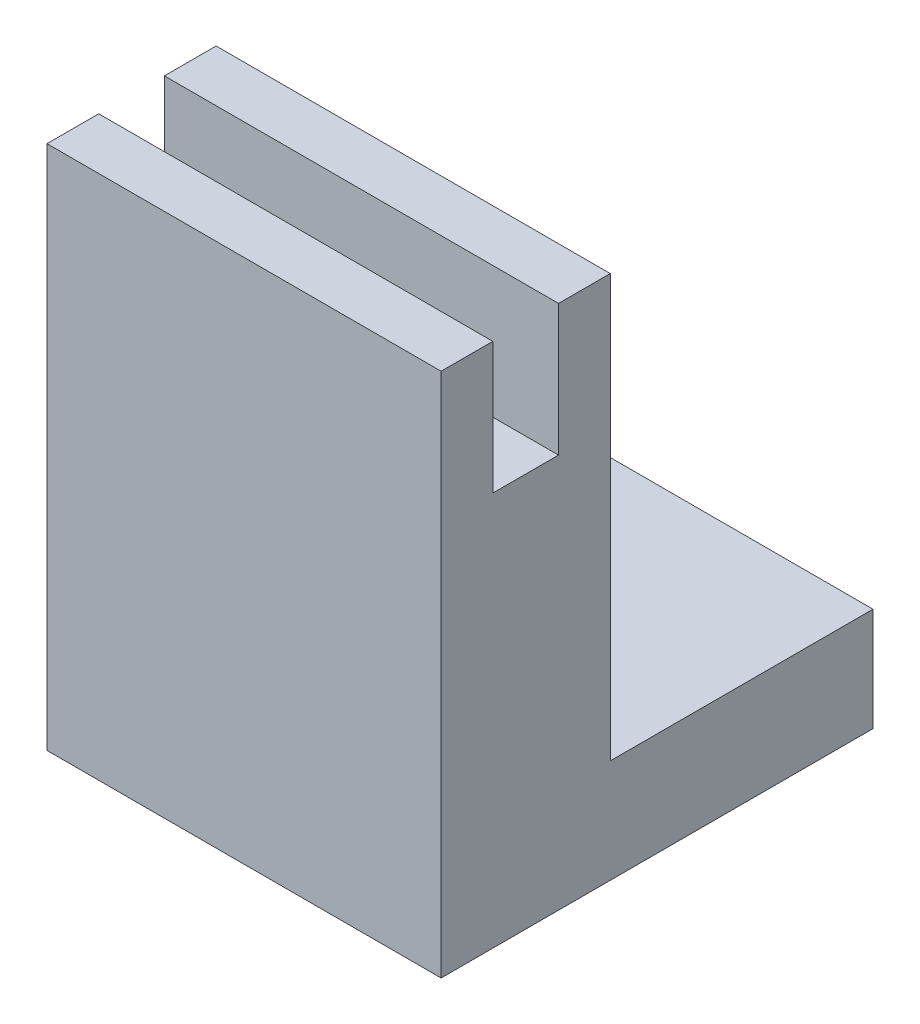
ISO-10303-21;
HEADER;
FILE_DESCRIPTION(('STEP AP214'),'2;1');
FILE_NAME('part.step','',(''),(''),'','','');
FILE_SCHEMA(('AUTOMOTIVE_DESIGN { 1 0 10303 214 1 1 1 1 }'));
ENDSEC;
DATA;
#1=APPLICATION_CONTEXT('core data for automotive mechanical design processes');
#2=APPLICATION_PROTOCOL_DEFINITION('international standard','automotive_design',2000,#1);
#3=PRODUCT_CONTEXT('',#1,'mechanical');
#4=PRODUCT('Part','Part','',(#3));
#5=PRODUCT_RELATED_PRODUCT_CATEGORY('part','',(#4));
#6=PRODUCT_DEFINITION_FORMATION('','',#4);
#7=PRODUCT_DEFINITION_CONTEXT('part definition',#1,'design');
#8=PRODUCT_DEFINITION('design','',#6,#7);
#9=PRODUCT_DEFINITION_SHAPE('','',#8);
#10=(LENGTH_UNIT() NAMED_UNIT(*) SI_UNIT(.MILLI.,.METRE.));
#11=(NAMED_UNIT(*) PLANE_ANGLE_UNIT() SI_UNIT($,.RADIAN.));
#12=(NAMED_UNIT(*) SI_UNIT($,.STERADIAN.) SOLID_ANGLE_UNIT());
#13=UNCERTAINTY_MEASURE_WITH_UNIT(LENGTH_MEASURE(1.E-05),#10,'distance_accuracy_value','');
#14=(GEOMETRIC_REPRESENTATION_CONTEXT(3) GLOBAL_UNCERTAINTY_ASSIGNED_CONTEXT((#13)) GLOBAL_UNIT_ASSIGNED_CONTEXT((#10,
#11,#12)) REPRESENTATION_CONTEXT('',''));
#15=CARTESIAN_POINT('',(0.,0.,0.));
#16=DIRECTION('',(0.,0.,1.));
#17=DIRECTION('',(1.,0.,0.));
#18=AXIS2_PLACEMENT_3D('',#15,#16,#17);
#19=CARTESIAN_POINT('',(38.1,50.8,0.));
#20=DIRECTION('',(0.,0.,-1.));
#21=DIRECTION('',(0.,1.,0.));
#22=AXIS2_PLACEMENT_3D('',#19,#20,#21);
#23=PLANE('',#22);
#24=DIRECTION('',(0.,-1.,0.));
#25=VECTOR('',#24,1.);
#26=CARTESIAN_POINT('',(0.,50.8,0.));
#27=LINE('',#26,#25);
#28=CARTESIAN_POINT('',(0.,50.8,0.));
#29=VERTEX_POINT('',#28);
#30=CARTESIAN_POINT('',(0.,0.,0.));
#31=VERTEX_POINT('',#30);
#32=EDGE_CURVE('E145',#29,#31,#27,.T.);
#33=ORIENTED_EDGE('',*,*,#32,.T.);
#34=DIRECTION('',(-1.,0.,0.));
#35=VECTOR('',#34,1.);
#36=CARTESIAN_POINT('',(38.1,0.,0.));
#37=LINE('',#36,#35);
#38=CARTESIAN_POINT('',(38.1,0.,0.));
#39=VERTEX_POINT('',#38);
#40=EDGE_CURVE('E11',#39,#31,#37,.T.);
#41=ORIENTED_EDGE('',*,*,#40,.F.);
#42=DIRECTION('',(0.,-1.,0.));
#43=VECTOR('',#42,1.);
#44=CARTESIAN_POINT('',(38.1,50.8,0.));
#45=LINE('',#44,#43);
#46=CARTESIAN_POINT('',(38.1,50.8,0.));
#47=VERTEX_POINT('',#46);
#48=EDGE_CURVE('E163',#47,#39,#45,.T.);
#49=ORIENTED_EDGE('',*,*,#48,.F.);
#50=DIRECTION('',(-1.,0.,0.));
#51=VECTOR('',#50,1.);
#52=CARTESIAN_POINT('',(38.1,50.8,0.));
#53=LINE('',#52,#51);
#54=EDGE_CURVE('E141',#47,#29,#53,.T.);
#55=ORIENTED_EDGE('',*,*,#54,.T.);
#56=EDGE_LOOP('',(#33,#41,#49,#55));
#57=FACE_BOUND('',#56,.T.);
#58=ADVANCED_FACE('F37',(#57),#23,.F.);
#59=CARTESIAN_POINT('',(38.1,0.,0.));
#60=DIRECTION('',(0.,1.,0.));
#61=DIRECTION('',(0.,0.,1.));
#62=AXIS2_PLACEMENT_3D('',#59,#60,#61);
#63=PLANE('',#62);
#64=DIRECTION('',(0.,0.,-1.));
#65=VECTOR('',#64,1.);
#66=CARTESIAN_POINT('',(0.,0.,0.));
#67=LINE('',#66,#65);
#68=CARTESIAN_POINT('',(0.,0.,-41.75));
#69=VERTEX_POINT('',#68);
#70=EDGE_CURVE('E148',#31,#69,#67,.T.);
#71=ORIENTED_EDGE('',*,*,#70,.T.);
#72=DIRECTION('',(-1.,0.,0.));
#73=VECTOR('',#72,1.);
#74=CARTESIAN_POINT('',(38.1,0.,-41.75));
#75=LINE('',#74,#73);
#76=CARTESIAN_POINT('',(38.1,0.,-41.75));
#77=VERTEX_POINT('',#76);
#78=EDGE_CURVE('E45',#77,#69,#75,.T.);
#79=ORIENTED_EDGE('',*,*,#78,.F.);
#80=DIRECTION('',(0.,0.,-1.));
#81=VECTOR('',#80,1.);
#82=CARTESIAN_POINT('',(38.1,0.,0.));
#83=LINE('',#82,#81);
#84=EDGE_CURVE('E102',#39,#77,#83,.T.);
#85=ORIENTED_EDGE('',*,*,#84,.F.);
#86=ORIENTED_EDGE('',*,*,#40,.T.);
#87=EDGE_LOOP('',(#71,#79,#85,#86));
#88=FACE_BOUND('',#87,.T.);
#89=ADVANCED_FACE('F212',(#88),#63,.F.);
#90=CARTESIAN_POINT('',(38.1,0.,-41.75));
#91=DIRECTION('',(0.,0.,1.));
#92=DIRECTION('',(1.,0.,0.));
#93=AXIS2_PLACEMENT_3D('',#90,#91,#92);
#94=PLANE('',#93);
#95=DIRECTION('',(0.,1.,0.));
#96=VECTOR('',#95,1.);
#97=CARTESIAN_POINT('',(0.,0.,-41.75));
#98=LINE('',#97,#96);
#99=CARTESIAN_POINT('',(0.,9.99999999999999,-41.75));
#100=VERTEX_POINT('',#99);
#101=EDGE_CURVE('E150',#69,#100,#98,.T.);
#102=ORIENTED_EDGE('',*,*,#101,.T.);
#103=DIRECTION('',(-1.,0.,0.));
#104=VECTOR('',#103,1.);
#105=CARTESIAN_POINT('',(38.1,9.99999999999999,-41.75));
#106=LINE('',#105,#104);
#107=CARTESIAN_POINT('',(38.1,9.99999999999999,-41.75));
#108=VERTEX_POINT('',#107);
#109=EDGE_CURVE('E176',#108,#100,#106,.T.);
#110=ORIENTED_EDGE('',*,*,#109,.F.);
#111=DIRECTION('',(0.,1.,0.));
#112=VECTOR('',#111,1.);
#113=CARTESIAN_POINT('',(38.1,0.,-41.75));
#114=LINE('',#113,#112);
#115=EDGE_CURVE('E184',#77,#108,#114,.T.);
#116=ORIENTED_EDGE('',*,*,#115,.F.);
#117=ORIENTED_EDGE('',*,*,#78,.T.);
#118=EDGE_LOOP('',(#102,#110,#116,#117));
#119=FACE_BOUND('',#118,.T.);
#120=ADVANCED_FACE('F182',(#119),#94,.F.);
#121=CARTESIAN_POINT('',(38.1,9.99999999999999,-41.75));
#122=DIRECTION('',(0.,-1.,0.));
#123=DIRECTION('',(0.,0.,-1.));
#124=AXIS2_PLACEMENT_3D('',#121,#122,#123);
#125=PLANE('',#124);
#126=DIRECTION('',(0.,0.,1.));
#127=VECTOR('',#126,1.);
#128=CARTESIAN_POINT('',(0.,9.99999999999999,-41.75));
#129=LINE('',#128,#127);
#130=CARTESIAN_POINT('',(0.,9.99999999999999,-16.35));
#131=VERTEX_POINT('',#130);
#132=EDGE_CURVE('E152',#100,#131,#129,.T.);
#133=ORIENTED_EDGE('',*,*,#132,.T.);
#134=DIRECTION('',(-1.,0.,0.));
#135=VECTOR('',#134,1.);
#136=CARTESIAN_POINT('',(38.1,9.99999999999999,-16.35));
#137=LINE('',#136,#135);
#138=CARTESIAN_POINT('',(38.1,9.99999999999999,-16.35));
#139=VERTEX_POINT('',#138);
#140=EDGE_CURVE('E173',#139,#131,#137,.T.);
#141=ORIENTED_EDGE('',*,*,#140,.F.);
#142=DIRECTION('',(0.,0.,1.));
#143=VECTOR('',#142,1.);
#144=CARTESIAN_POINT('',(38.1,9.99999999999999,-41.75));
#145=LINE('',#144,#143);
#146=EDGE_CURVE('E202',#108,#139,#145,.T.);
#147=ORIENTED_EDGE('',*,*,#146,.F.);
#148=ORIENTED_EDGE('',*,*,#109,.T.);
#149=EDGE_LOOP('',(#133,#141,#147,#148));
#150=FACE_BOUND('',#149,.T.);
#151=ADVANCED_FACE('F193',(#150),#125,.F.);
#152=CARTESIAN_POINT('',(38.1,9.99999999999999,-16.35));
#153=DIRECTION('',(0.,0.,1.));
#154=DIRECTION('',(1.,0.,0.));
#155=AXIS2_PLACEMENT_3D('',#152,#153,#154);
#156=PLANE('',#155);
#157=DIRECTION('',(0.,1.,0.));
#158=VECTOR('',#157,1.);
#159=CARTESIAN_POINT('',(0.,9.99999999999999,-16.35));
#160=LINE('',#159,#158);
#161=CARTESIAN_POINT('',(0.,50.8,-16.35));
#162=VERTEX_POINT('',#161);
#163=EDGE_CURVE('E154',#131,#162,#160,.T.);
#164=ORIENTED_EDGE('',*,*,#163,.T.);
#165=DIRECTION('',(-1.,0.,0.));
#166=VECTOR('',#165,1.);
#167=CARTESIAN_POINT('',(38.1,50.8,-16.35));
#168=LINE('',#167,#166);
#169=CARTESIAN_POINT('',(38.1,50.8,-16.35));
#170=VERTEX_POINT('',#169);
#171=EDGE_CURVE('E170',#170,#162,#168,.T.);
#172=ORIENTED_EDGE('',*,*,#171,.F.);
#173=DIRECTION('',(0.,1.,0.));
#174=VECTOR('',#173,1.);
#175=CARTESIAN_POINT('',(38.1,9.99999999999999,-16.35));
#176=LINE('',#175,#174);
#177=EDGE_CURVE('E199',#139,#170,#176,.T.);
#178=ORIENTED_EDGE('',*,*,#177,.F.);
#179=ORIENTED_EDGE('',*,*,#140,.T.);
#180=EDGE_LOOP('',(#164,#172,#178,#179));
#181=FACE_BOUND('',#180,.T.);
#182=ADVANCED_FACE('F197',(#181),#156,.F.);
#183=CARTESIAN_POINT('',(38.1,50.8,-16.35));
#184=DIRECTION('',(0.,-1.,0.));
#185=DIRECTION('',(0.,0.,-1.));
#186=AXIS2_PLACEMENT_3D('',#183,#184,#185);
#187=PLANE('',#186);
#188=DIRECTION('',(0.,0.,1.));
#189=VECTOR('',#188,1.);
#190=CARTESIAN_POINT('',(0.,50.8,-16.35));
#191=LINE('',#190,#189);
#192=CARTESIAN_POINT('',(0.,50.8,-11.35));
#193=VERTEX_POINT('',#192);
#194=EDGE_CURVE('E156',#162,#193,#191,.T.);
#195=ORIENTED_EDGE('',*,*,#194,.T.);
#196=DIRECTION('',(-1.,0.,0.));
#197=VECTOR('',#196,1.);
#198=CARTESIAN_POINT('',(38.1,50.8,-11.35));
#199=LINE('',#198,#197);
#200=CARTESIAN_POINT('',(38.1,50.8,-11.35));
#201=VERTEX_POINT('',#200);
#202=EDGE_CURVE('E167',#201,#193,#199,.T.);
#203=ORIENTED_EDGE('',*,*,#202,.F.);
#204=DIRECTION('',(0.,0.,1.));
#205=VECTOR('',#204,1.);
#206=CARTESIAN_POINT('',(38.1,50.8,-16.35));
#207=LINE('',#206,#205);
#208=EDGE_CURVE('E201',#170,#201,#207,.T.);
#209=ORIENTED_EDGE('',*,*,#208,.F.);
#210=ORIENTED_EDGE('',*,*,#171,.T.);
#211=EDGE_LOOP('',(#195,#203,#209,#210));
#212=FACE_BOUND('',#211,.T.);
#213=ADVANCED_FACE('F224',(#212),#187,.F.);
#214=CARTESIAN_POINT('',(38.1,50.8,-11.35));
#215=DIRECTION('',(0.,0.,-1.));
#216=DIRECTION('',(0.,1.,0.));
#217=AXIS2_PLACEMENT_3D('',#214,#215,#216);
#218=PLANE('',#217);
#219=DIRECTION('',(0.,-1.,0.));
#220=VECTOR('',#219,1.);
#221=CARTESIAN_POINT('',(0.,50.8,-11.35));
#222=LINE('',#221,#220);
#223=CARTESIAN_POINT('',(0.,38.1,-11.35));
#224=VERTEX_POINT('',#223);
#225=EDGE_CURVE('E158',#193,#224,#222,.T.);
#226=ORIENTED_EDGE('',*,*,#225,.T.);
#227=DIRECTION('',(-1.,0.,0.));
#228=VECTOR('',#227,1.);
#229=CARTESIAN_POINT('',(38.1,38.1,-11.35));
#230=LINE('',#229,#228);
#231=CARTESIAN_POINT('',(38.1,38.1,-11.35));
#232=VERTEX_POINT('',#231);
#233=EDGE_CURVE('E136',#232,#224,#230,.T.);
#234=ORIENTED_EDGE('',*,*,#233,.F.);
#235=DIRECTION('',(0.,-1.,0.));
#236=VECTOR('',#235,1.);
#237=CARTESIAN_POINT('',(38.1,50.8,-11.35));
#238=LINE('',#237,#236);
#239=EDGE_CURVE('E127',#201,#232,#238,.T.);
#240=ORIENTED_EDGE('',*,*,#239,.F.);
#241=ORIENTED_EDGE('',*,*,#202,.T.);
#242=EDGE_LOOP('',(#226,#234,#240,#241));
#243=FACE_BOUND('',#242,.T.);
#244=ADVANCED_FACE('F227',(#243),#218,.F.);
#245=CARTESIAN_POINT('',(38.1,38.1,-11.35));
#246=DIRECTION('',(0.,-1.,0.));
#247=DIRECTION('',(0.,0.,-1.));
#248=AXIS2_PLACEMENT_3D('',#245,#246,#247);
#249=PLANE('',#248);
#250=DIRECTION('',(0.,0.,1.));
#251=VECTOR('',#250,1.);
#252=CARTESIAN_POINT('',(0.,38.1,-11.35));
#253=LINE('',#252,#251);
#254=CARTESIAN_POINT('',(0.,38.1,-4.99999999999999));
#255=VERTEX_POINT('',#254);
#256=EDGE_CURVE('E135',#224,#255,#253,.T.);
#257=ORIENTED_EDGE('',*,*,#256,.T.);
#258=DIRECTION('',(-1.,0.,0.));
#259=VECTOR('',#258,1.);
#260=CARTESIAN_POINT('',(38.1,38.1,-4.99999999999999));
#261=LINE('',#260,#259);
#262=CARTESIAN_POINT('',(38.1,38.1,-4.99999999999999));
#263=VERTEX_POINT('',#262);
#264=EDGE_CURVE('E132',#263,#255,#261,.T.);
#265=ORIENTED_EDGE('',*,*,#264,.F.);
#266=DIRECTION('',(0.,0.,1.));
#267=VECTOR('',#266,1.);
#268=CARTESIAN_POINT('',(38.1,38.1,-11.35));
#269=LINE('',#268,#267);
#270=EDGE_CURVE('E121',#232,#263,#269,.T.);
#271=ORIENTED_EDGE('',*,*,#270,.F.);
#272=ORIENTED_EDGE('',*,*,#233,.T.);
#273=EDGE_LOOP('',(#257,#265,#271,#272));
#274=FACE_BOUND('',#273,.T.);
#275=ADVANCED_FACE('F133',(#274),#249,.F.);
#276=CARTESIAN_POINT('',(38.1,38.1,-4.99999999999999));
#277=DIRECTION('',(0.,0.,1.));
#278=DIRECTION('',(0.,-1.,0.));
#279=AXIS2_PLACEMENT_3D('',#276,#277,#278);
#280=PLANE('',#279);
#281=DIRECTION('',(0.,1.,0.));
#282=VECTOR('',#281,1.);
#283=CARTESIAN_POINT('',(0.,38.1,-4.99999999999999));
#284=LINE('',#283,#282);
#285=CARTESIAN_POINT('',(0.,50.8,-4.99999999999999));
#286=VERTEX_POINT('',#285);
#287=EDGE_CURVE('E88',#255,#286,#284,.T.);
#288=ORIENTED_EDGE('',*,*,#287,.T.);
#289=DIRECTION('',(-1.,0.,0.));
#290=VECTOR('',#289,1.);
#291=CARTESIAN_POINT('',(38.1,50.8,-4.99999999999999));
#292=LINE('',#291,#290);
#293=CARTESIAN_POINT('',(38.1,50.8,-4.99999999999999));
#294=VERTEX_POINT('',#293);
#295=EDGE_CURVE('E137',#294,#286,#292,.T.);
#296=ORIENTED_EDGE('',*,*,#295,.F.);
#297=DIRECTION('',(0.,1.,0.));
#298=VECTOR('',#297,1.);
#299=CARTESIAN_POINT('',(38.1,38.1,-4.99999999999999));
#300=LINE('',#299,#298);
#301=EDGE_CURVE('E125',#263,#294,#300,.T.);
#302=ORIENTED_EDGE('',*,*,#301,.F.);
#303=ORIENTED_EDGE('',*,*,#264,.T.);
#304=EDGE_LOOP('',(#288,#296,#302,#303));
#305=FACE_BOUND('',#304,.T.);
#306=ADVANCED_FACE('F139',(#305),#280,.F.);
#307=CARTESIAN_POINT('',(38.1,50.8,-4.99999999999999));
#308=DIRECTION('',(0.,-1.,0.));
#309=DIRECTION('',(0.,0.,-1.));
#310=AXIS2_PLACEMENT_3D('',#307,#308,#309);
#311=PLANE('',#310);
#312=DIRECTION('',(0.,0.,1.));
#313=VECTOR('',#312,1.);
#314=CARTESIAN_POINT('',(0.,50.8,-4.99999999999999));
#315=LINE('',#314,#313);
#316=EDGE_CURVE('E94',#286,#29,#315,.T.);
#317=ORIENTED_EDGE('',*,*,#316,.T.);
#318=ORIENTED_EDGE('',*,*,#54,.F.);
#319=DIRECTION('',(0.,0.,1.));
#320=VECTOR('',#319,1.);
#321=CARTESIAN_POINT('',(38.1,50.8,-4.99999999999999));
#322=LINE('',#321,#320);
#323=EDGE_CURVE('E53',#294,#47,#322,.T.);
#324=ORIENTED_EDGE('',*,*,#323,.F.);
#325=ORIENTED_EDGE('',*,*,#295,.T.);
#326=EDGE_LOOP('',(#317,#318,#324,#325));
#327=FACE_BOUND('',#326,.T.);
#328=ADVANCED_FACE('F236',(#327),#311,.F.);
#329=CARTESIAN_POINT('',(38.1,0.,0.));
#330=DIRECTION('',(1.,0.,0.));
#331=DIRECTION('',(0.,0.,-1.));
#332=AXIS2_PLACEMENT_3D('',#329,#330,#331);
#333=PLANE('',#332);
#334=ORIENTED_EDGE('',*,*,#48,.T.);
#335=ORIENTED_EDGE('',*,*,#84,.T.);
#336=ORIENTED_EDGE('',*,*,#115,.T.);
#337=ORIENTED_EDGE('',*,*,#146,.T.);
#338=ORIENTED_EDGE('',*,*,#177,.T.);
#339=ORIENTED_EDGE('',*,*,#208,.T.);
#340=ORIENTED_EDGE('',*,*,#239,.T.);
#341=ORIENTED_EDGE('',*,*,#270,.T.);
#342=ORIENTED_EDGE('',*,*,#301,.T.);
#343=ORIENTED_EDGE('',*,*,#323,.T.);
#344=EDGE_LOOP('',(#334,#335,#336,#337,#338,#339,#340,#341,#342,#343));
#345=FACE_BOUND('',#344,.T.);
#346=ADVANCED_FACE('F123',(#345),#333,.T.);
#347=CARTESIAN_POINT('',(0.,0.,0.));
#348=DIRECTION('',(1.,0.,0.));
#349=DIRECTION('',(0.,0.,-1.));
#350=AXIS2_PLACEMENT_3D('',#347,#348,#349);
#351=PLANE('',#350);
#352=ORIENTED_EDGE('',*,*,#32,.F.);
#353=ORIENTED_EDGE('',*,*,#316,.F.);
#354=ORIENTED_EDGE('',*,*,#287,.F.);
#355=ORIENTED_EDGE('',*,*,#256,.F.);
#356=ORIENTED_EDGE('',*,*,#225,.F.);
#357=ORIENTED_EDGE('',*,*,#194,.F.);
#358=ORIENTED_EDGE('',*,*,#163,.F.);
#359=ORIENTED_EDGE('',*,*,#132,.F.);
#360=ORIENTED_EDGE('',*,*,#101,.F.);
#361=ORIENTED_EDGE('',*,*,#70,.F.);
#362=EDGE_LOOP('',(#352,#353,#354,#355,#356,#357,#358,#359,#360,#361));
#363=FACE_BOUND('',#362,.T.);
#364=ADVANCED_FACE('F188',(#363),#351,.F.);
#365=CLOSED_SHELL('',(#58,#89,#120,#151,#182,#213,#244,#275,#306,#328,#346,#364));
#366=MANIFOLD_SOLID_BREP('B2',#365);
#367=ADVANCED_BREP_SHAPE_REPRESENTATION('',(#18,#366),#14);
#368=SHAPE_DEFINITION_REPRESENTATION(#9,#367);
ENDSEC;
END-ISO-10303-21;
